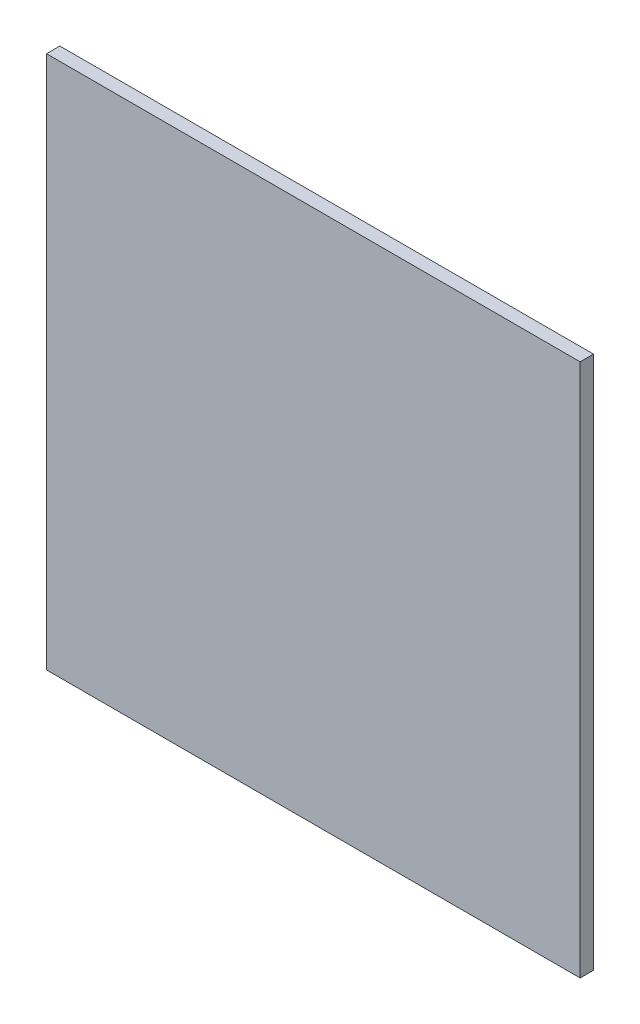
ISO-10303-21;
HEADER;
FILE_DESCRIPTION(('STEP AP214'),'2;1');
FILE_NAME('part.step','',(''),(''),'','','');
FILE_SCHEMA(('AUTOMOTIVE_DESIGN { 1 0 10303 214 1 1 1 1 }'));
ENDSEC;
DATA;
#1=APPLICATION_CONTEXT('core data for automotive mechanical design processes');
#2=APPLICATION_PROTOCOL_DEFINITION('international standard','automotive_design',2000,#1);
#3=PRODUCT_CONTEXT('',#1,'mechanical');
#4=PRODUCT('Part','Part','',(#3));
#5=PRODUCT_RELATED_PRODUCT_CATEGORY('part','',(#4));
#6=PRODUCT_DEFINITION_FORMATION('','',#4);
#7=PRODUCT_DEFINITION_CONTEXT('part definition',#1,'design');
#8=PRODUCT_DEFINITION('design','',#6,#7);
#9=PRODUCT_DEFINITION_SHAPE('','',#8);
#10=(LENGTH_UNIT() NAMED_UNIT(*) SI_UNIT(.MILLI.,.METRE.));
#11=(NAMED_UNIT(*) PLANE_ANGLE_UNIT() SI_UNIT($,.RADIAN.));
#12=(NAMED_UNIT(*) SI_UNIT($,.STERADIAN.) SOLID_ANGLE_UNIT());
#13=UNCERTAINTY_MEASURE_WITH_UNIT(LENGTH_MEASURE(1.E-05),#10,'distance_accuracy_value','');
#14=(GEOMETRIC_REPRESENTATION_CONTEXT(3) GLOBAL_UNCERTAINTY_ASSIGNED_CONTEXT((#13)) GLOBAL_UNIT_ASSIGNED_CONTEXT((#10,
#11,#12)) REPRESENTATION_CONTEXT('',''));
#15=CARTESIAN_POINT('',(0.,0.,0.));
#16=DIRECTION('',(0.,0.,1.));
#17=DIRECTION('',(1.,0.,0.));
#18=AXIS2_PLACEMENT_3D('',#15,#16,#17);
#19=CARTESIAN_POINT('',(127.,-127.,0.));
#20=DIRECTION('',(1.,0.,0.));
#21=DIRECTION('',(0.,1.,0.));
#22=AXIS2_PLACEMENT_3D('',#19,#20,#21);
#23=PLANE('',#22);
#24=DIRECTION('',(0.,-1.,0.));
#25=VECTOR('',#24,1.);
#26=CARTESIAN_POINT('',(127.,127.,0.));
#27=LINE('',#26,#25);
#28=CARTESIAN_POINT('',(127.,127.,0.));
#29=VERTEX_POINT('',#28);
#30=CARTESIAN_POINT('',(127.,-127.,0.));
#31=VERTEX_POINT('',#30);
#32=EDGE_CURVE('E34',#29,#31,#27,.T.);
#33=ORIENTED_EDGE('',*,*,#32,.F.);
#34=DIRECTION('',(0.,0.,1.));
#35=VECTOR('',#34,1.);
#36=CARTESIAN_POINT('',(127.,127.,0.));
#37=LINE('',#36,#35);
#38=CARTESIAN_POINT('',(127.,127.,6.35));
#39=VERTEX_POINT('',#38);
#40=EDGE_CURVE('E11',#29,#39,#37,.T.);
#41=ORIENTED_EDGE('',*,*,#40,.T.);
#42=DIRECTION('',(0.,1.,0.));
#43=VECTOR('',#42,1.);
#44=CARTESIAN_POINT('',(127.,127.,6.35));
#45=LINE('',#44,#43);
#46=CARTESIAN_POINT('',(127.,-127.,6.35));
#47=VERTEX_POINT('',#46);
#48=EDGE_CURVE('E78',#47,#39,#45,.T.);
#49=ORIENTED_EDGE('',*,*,#48,.F.);
#50=DIRECTION('',(0.,0.,1.));
#51=VECTOR('',#50,1.);
#52=CARTESIAN_POINT('',(127.,-127.,0.));
#53=LINE('',#52,#51);
#54=EDGE_CURVE('E26',#31,#47,#53,.T.);
#55=ORIENTED_EDGE('',*,*,#54,.F.);
#56=EDGE_LOOP('',(#33,#41,#49,#55));
#57=FACE_BOUND('',#56,.T.);
#58=ADVANCED_FACE('F16',(#57),#23,.T.);
#59=CARTESIAN_POINT('',(-127.,-127.,0.));
#60=DIRECTION('',(0.,-1.,0.));
#61=DIRECTION('',(1.,0.,0.));
#62=AXIS2_PLACEMENT_3D('',#59,#60,#61);
#63=PLANE('',#62);
#64=DIRECTION('',(-1.,0.,0.));
#65=VECTOR('',#64,1.);
#66=CARTESIAN_POINT('',(127.,-127.,0.));
#67=LINE('',#66,#65);
#68=CARTESIAN_POINT('',(-127.,-127.,0.));
#69=VERTEX_POINT('',#68);
#70=EDGE_CURVE('E81',#31,#69,#67,.T.);
#71=ORIENTED_EDGE('',*,*,#70,.F.);
#72=ORIENTED_EDGE('',*,*,#54,.T.);
#73=DIRECTION('',(1.,0.,0.));
#74=VECTOR('',#73,1.);
#75=CARTESIAN_POINT('',(127.,-127.,6.35));
#76=LINE('',#75,#74);
#77=CARTESIAN_POINT('',(-127.,-127.,6.35));
#78=VERTEX_POINT('',#77);
#79=EDGE_CURVE('E70',#78,#47,#76,.T.);
#80=ORIENTED_EDGE('',*,*,#79,.F.);
#81=DIRECTION('',(0.,0.,1.));
#82=VECTOR('',#81,1.);
#83=CARTESIAN_POINT('',(-127.,-127.,0.));
#84=LINE('',#83,#82);
#85=EDGE_CURVE('E66',#69,#78,#84,.T.);
#86=ORIENTED_EDGE('',*,*,#85,.F.);
#87=EDGE_LOOP('',(#71,#72,#80,#86));
#88=FACE_BOUND('',#87,.T.);
#89=ADVANCED_FACE('F90',(#88),#63,.T.);
#90=CARTESIAN_POINT('',(-127.,127.,0.));
#91=DIRECTION('',(-1.,0.,0.));
#92=DIRECTION('',(0.,-1.,0.));
#93=AXIS2_PLACEMENT_3D('',#90,#91,#92);
#94=PLANE('',#93);
#95=DIRECTION('',(0.,1.,0.));
#96=VECTOR('',#95,1.);
#97=CARTESIAN_POINT('',(-127.,-127.,0.));
#98=LINE('',#97,#96);
#99=CARTESIAN_POINT('',(-127.,127.,0.));
#100=VERTEX_POINT('',#99);
#101=EDGE_CURVE('E54',#69,#100,#98,.T.);
#102=ORIENTED_EDGE('',*,*,#101,.F.);
#103=ORIENTED_EDGE('',*,*,#85,.T.);
#104=DIRECTION('',(0.,-1.,0.));
#105=VECTOR('',#104,1.);
#106=CARTESIAN_POINT('',(-127.,-127.,6.35));
#107=LINE('',#106,#105);
#108=CARTESIAN_POINT('',(-127.,127.,6.35));
#109=VERTEX_POINT('',#108);
#110=EDGE_CURVE('E60',#109,#78,#107,.T.);
#111=ORIENTED_EDGE('',*,*,#110,.F.);
#112=DIRECTION('',(0.,0.,1.));
#113=VECTOR('',#112,1.);
#114=CARTESIAN_POINT('',(-127.,127.,0.));
#115=LINE('',#114,#113);
#116=EDGE_CURVE('E63',#100,#109,#115,.T.);
#117=ORIENTED_EDGE('',*,*,#116,.F.);
#118=EDGE_LOOP('',(#102,#103,#111,#117));
#119=FACE_BOUND('',#118,.T.);
#120=ADVANCED_FACE('F62',(#119),#94,.T.);
#121=CARTESIAN_POINT('',(127.,127.,0.));
#122=DIRECTION('',(0.,1.,0.));
#123=DIRECTION('',(-1.,0.,0.));
#124=AXIS2_PLACEMENT_3D('',#121,#122,#123);
#125=PLANE('',#124);
#126=DIRECTION('',(1.,0.,0.));
#127=VECTOR('',#126,1.);
#128=CARTESIAN_POINT('',(-127.,127.,0.));
#129=LINE('',#128,#127);
#130=EDGE_CURVE('E75',#100,#29,#129,.T.);
#131=ORIENTED_EDGE('',*,*,#130,.F.);
#132=ORIENTED_EDGE('',*,*,#116,.T.);
#133=DIRECTION('',(-1.,0.,0.));
#134=VECTOR('',#133,1.);
#135=CARTESIAN_POINT('',(-127.,127.,6.35));
#136=LINE('',#135,#134);
#137=EDGE_CURVE('E20',#39,#109,#136,.T.);
#138=ORIENTED_EDGE('',*,*,#137,.F.);
#139=ORIENTED_EDGE('',*,*,#40,.F.);
#140=EDGE_LOOP('',(#131,#132,#138,#139));
#141=FACE_BOUND('',#140,.T.);
#142=ADVANCED_FACE('F74',(#141),#125,.T.);
#143=CARTESIAN_POINT('',(0.,0.,6.35));
#144=DIRECTION('',(0.,0.,1.));
#145=DIRECTION('',(1.,0.,0.));
#146=AXIS2_PLACEMENT_3D('',#143,#144,#145);
#147=PLANE('',#146);
#148=ORIENTED_EDGE('',*,*,#137,.T.);
#149=ORIENTED_EDGE('',*,*,#110,.T.);
#150=ORIENTED_EDGE('',*,*,#79,.T.);
#151=ORIENTED_EDGE('',*,*,#48,.T.);
#152=EDGE_LOOP('',(#148,#149,#150,#151));
#153=FACE_BOUND('',#152,.T.);
#154=ADVANCED_FACE('F77',(#153),#147,.T.);
#155=CARTESIAN_POINT('',(0.,0.,0.));
#156=DIRECTION('',(0.,0.,1.));
#157=DIRECTION('',(1.,0.,0.));
#158=AXIS2_PLACEMENT_3D('',#155,#156,#157);
#159=PLANE('',#158);
#160=ORIENTED_EDGE('',*,*,#130,.T.);
#161=ORIENTED_EDGE('',*,*,#32,.T.);
#162=ORIENTED_EDGE('',*,*,#70,.T.);
#163=ORIENTED_EDGE('',*,*,#101,.T.);
#164=EDGE_LOOP('',(#160,#161,#162,#163));
#165=FACE_BOUND('',#164,.T.);
#166=ADVANCED_FACE('F18',(#165),#159,.F.);
#167=CLOSED_SHELL('',(#58,#89,#120,#142,#154,#166));
#168=MANIFOLD_SOLID_BREP('B1',#167);
#169=ADVANCED_BREP_SHAPE_REPRESENTATION('',(#18,#168),#14);
#170=SHAPE_DEFINITION_REPRESENTATION(#9,#169);
ENDSEC;
END-ISO-10303-21;
